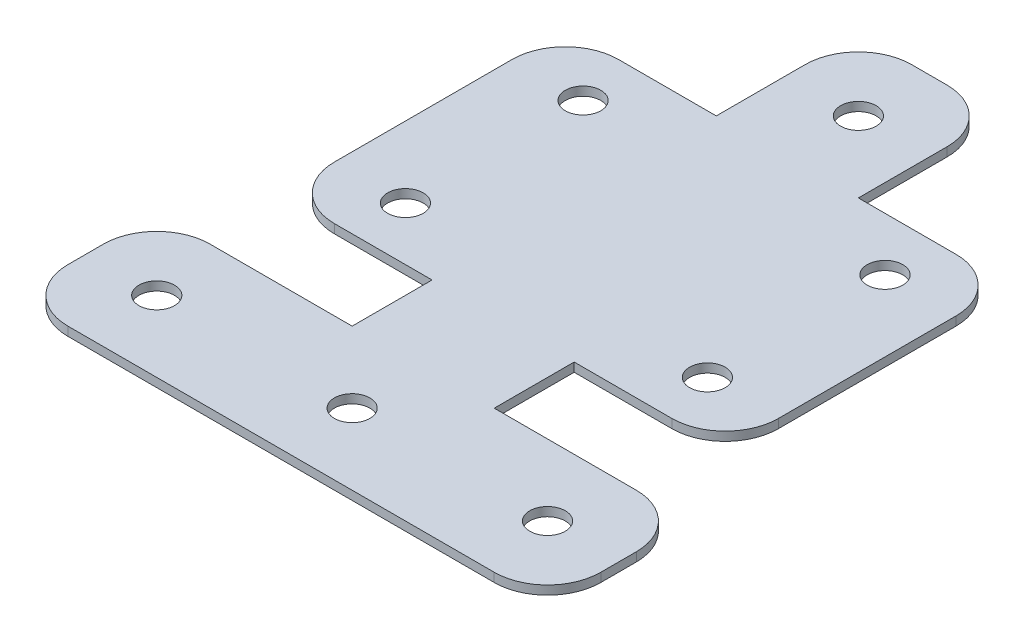
ISO-10303-21;
HEADER;
FILE_DESCRIPTION(('STEP AP214'),'2;1');
FILE_NAME('part.step','',(''),(''),'','','');
FILE_SCHEMA(('AUTOMOTIVE_DESIGN { 1 0 10303 214 1 1 1 1 }'));
ENDSEC;
DATA;
#1=APPLICATION_CONTEXT('core data for automotive mechanical design processes');
#2=APPLICATION_PROTOCOL_DEFINITION('international standard','automotive_design',2000,#1);
#3=PRODUCT_CONTEXT('',#1,'mechanical');
#4=PRODUCT('Part','Part','',(#3));
#5=PRODUCT_RELATED_PRODUCT_CATEGORY('part','',(#4));
#6=PRODUCT_DEFINITION_FORMATION('','',#4);
#7=PRODUCT_DEFINITION_CONTEXT('part definition',#1,'design');
#8=PRODUCT_DEFINITION('design','',#6,#7);
#9=PRODUCT_DEFINITION_SHAPE('','',#8);
#10=(LENGTH_UNIT() NAMED_UNIT(*) SI_UNIT(.MILLI.,.METRE.));
#11=(NAMED_UNIT(*) PLANE_ANGLE_UNIT() SI_UNIT($,.RADIAN.));
#12=(NAMED_UNIT(*) SI_UNIT($,.STERADIAN.) SOLID_ANGLE_UNIT());
#13=UNCERTAINTY_MEASURE_WITH_UNIT(LENGTH_MEASURE(1.E-05),#10,'distance_accuracy_value','');
#14=(GEOMETRIC_REPRESENTATION_CONTEXT(3) GLOBAL_UNCERTAINTY_ASSIGNED_CONTEXT((#13)) GLOBAL_UNIT_ASSIGNED_CONTEXT((#10,
#11,#12)) REPRESENTATION_CONTEXT('',''));
#15=CARTESIAN_POINT('',(0.,0.,0.));
#16=DIRECTION('',(0.,0.,1.));
#17=DIRECTION('',(1.,0.,0.));
#18=AXIS2_PLACEMENT_3D('',#15,#16,#17);
#19=CARTESIAN_POINT('',(0.,1.5875,0.));
#20=DIRECTION('',(0.,1.,0.));
#21=DIRECTION('',(0.,0.,1.));
#22=AXIS2_PLACEMENT_3D('',#19,#20,#21);
#23=PLANE('',#22);
#24=CARTESIAN_POINT('',(-26.9875,1.5875,-68.2625));
#25=DIRECTION('',(0.,1.,0.));
#26=DIRECTION('',(0.,0.,1.));
#27=AXIS2_PLACEMENT_3D('',#24,#25,#26);
#28=CIRCLE('',#27,3.175);
#29=CARTESIAN_POINT('',(-26.9875,1.5875,-65.0875));
#30=VERTEX_POINT('',#29);
#31=EDGE_CURVE('E986',#30,#30,#28,.T.);
#32=ORIENTED_EDGE('',*,*,#31,.F.);
#33=EDGE_LOOP('',(#32));
#34=FACE_BOUND('',#33,.T.);
#35=CARTESIAN_POINT('',(0.,1.5875,0.));
#36=DIRECTION('',(0.,1.,0.));
#37=DIRECTION('',(0.,0.,1.));
#38=AXIS2_PLACEMENT_3D('',#35,#36,#37);
#39=CIRCLE('',#38,3.175);
#40=CARTESIAN_POINT('',(0.,1.5875,3.175));
#41=VERTEX_POINT('',#40);
#42=EDGE_CURVE('E970',#41,#41,#39,.T.);
#43=ORIENTED_EDGE('',*,*,#42,.F.);
#44=EDGE_LOOP('',(#43));
#45=FACE_BOUND('',#44,.T.);
#46=CARTESIAN_POINT('',(0.,1.5875,-90.4875));
#47=DIRECTION('',(0.,1.,0.));
#48=DIRECTION('',(0.,0.,1.));
#49=AXIS2_PLACEMENT_3D('',#46,#47,#48);
#50=CIRCLE('',#49,3.175);
#51=CARTESIAN_POINT('',(0.,1.5875,-87.3125));
#52=VERTEX_POINT('',#51);
#53=EDGE_CURVE('E956',#52,#52,#50,.T.);
#54=ORIENTED_EDGE('',*,*,#53,.F.);
#55=EDGE_LOOP('',(#54));
#56=FACE_BOUND('',#55,.T.);
#57=CARTESIAN_POINT('',(26.9875,1.5875,-36.5125));
#58=DIRECTION('',(0.,1.,0.));
#59=DIRECTION('',(0.,0.,1.));
#60=AXIS2_PLACEMENT_3D('',#57,#58,#59);
#61=CIRCLE('',#60,3.175);
#62=CARTESIAN_POINT('',(26.9875,1.5875,-33.3375));
#63=VERTEX_POINT('',#62);
#64=EDGE_CURVE('E297',#63,#63,#61,.T.);
#65=ORIENTED_EDGE('',*,*,#64,.F.);
#66=EDGE_LOOP('',(#65));
#67=FACE_BOUND('',#66,.T.);
#68=DIRECTION('',(-1.,0.,0.));
#69=VECTOR('',#68,1.);
#70=CARTESIAN_POINT('',(-12.7,1.5875,-103.1875));
#71=LINE('',#70,#69);
#72=CARTESIAN_POINT('',(3.17499999999999,1.5875,-103.1875));
#73=VERTEX_POINT('',#72);
#74=CARTESIAN_POINT('',(-3.175,1.5875,-103.1875));
#75=VERTEX_POINT('',#74);
#76=EDGE_CURVE('E256',#73,#75,#71,.T.);
#77=ORIENTED_EDGE('',*,*,#76,.T.);
#78=CARTESIAN_POINT('',(-3.175,1.5875,-93.6625));
#79=DIRECTION('',(0.,1.,0.));
#80=DIRECTION('',(0.,0.,1.));
#81=AXIS2_PLACEMENT_3D('',#78,#79,#80);
#82=CIRCLE('',#81,9.525);
#83=CARTESIAN_POINT('',(-12.7,1.5875,-93.6625));
#84=VERTEX_POINT('',#83);
#85=EDGE_CURVE('E433',#75,#84,#82,.T.);
#86=ORIENTED_EDGE('',*,*,#85,.T.);
#87=DIRECTION('',(0.,0.,1.));
#88=VECTOR('',#87,1.);
#89=CARTESIAN_POINT('',(-12.7,1.5875,-77.7875));
#90=LINE('',#89,#88);
#91=CARTESIAN_POINT('',(-12.7,1.5875,-77.7875));
#92=VERTEX_POINT('',#91);
#93=EDGE_CURVE('E259',#84,#92,#90,.T.);
#94=ORIENTED_EDGE('',*,*,#93,.T.);
#95=DIRECTION('',(-1.,0.,0.));
#96=VECTOR('',#95,1.);
#97=CARTESIAN_POINT('',(-14.2875,1.5875,-77.7875));
#98=LINE('',#97,#96);
#99=CARTESIAN_POINT('',(-30.1625,1.5875,-77.7874999999999));
#100=VERTEX_POINT('',#99);
#101=EDGE_CURVE('E262',#92,#100,#98,.T.);
#102=ORIENTED_EDGE('',*,*,#101,.T.);
#103=CARTESIAN_POINT('',(-30.1625,1.5875,-68.2625));
#104=DIRECTION('',(0.,1.,0.));
#105=DIRECTION('',(0.,0.,1.));
#106=AXIS2_PLACEMENT_3D('',#103,#104,#105);
#107=CIRCLE('',#106,9.525);
#108=CARTESIAN_POINT('',(-39.6875,1.5875,-68.2625));
#109=VERTEX_POINT('',#108);
#110=EDGE_CURVE('E413',#100,#109,#107,.T.);
#111=ORIENTED_EDGE('',*,*,#110,.T.);
#112=DIRECTION('',(0.,0.,1.));
#113=VECTOR('',#112,1.);
#114=CARTESIAN_POINT('',(-39.6875,1.5875,-77.7875));
#115=LINE('',#114,#113);
#116=CARTESIAN_POINT('',(-39.6875,1.5875,-36.5125));
#117=VERTEX_POINT('',#116);
#118=EDGE_CURVE('E266',#109,#117,#115,.T.);
#119=ORIENTED_EDGE('',*,*,#118,.T.);
#120=CARTESIAN_POINT('',(-30.1625,1.5875,-36.5125));
#121=DIRECTION('',(0.,1.,0.));
#122=DIRECTION('',(0.,0.,1.));
#123=AXIS2_PLACEMENT_3D('',#120,#121,#122);
#124=CIRCLE('',#123,9.525);
#125=CARTESIAN_POINT('',(-30.1625,1.5875,-26.9875));
#126=VERTEX_POINT('',#125);
#127=EDGE_CURVE('E416',#117,#126,#124,.T.);
#128=ORIENTED_EDGE('',*,*,#127,.T.);
#129=DIRECTION('',(1.,0.,0.));
#130=VECTOR('',#129,1.);
#131=CARTESIAN_POINT('',(-39.6875,1.5875,-26.9875));
#132=LINE('',#131,#130);
#133=CARTESIAN_POINT('',(-12.7,1.5875,-26.9875));
#134=VERTEX_POINT('',#133);
#135=EDGE_CURVE('E270',#126,#134,#132,.T.);
#136=ORIENTED_EDGE('',*,*,#135,.T.);
#137=DIRECTION('',(0.,0.,1.));
#138=VECTOR('',#137,1.);
#139=CARTESIAN_POINT('',(-12.7,1.5875,-25.4));
#140=LINE('',#139,#138);
#141=CARTESIAN_POINT('',(-12.7,1.5875,-12.7));
#142=VERTEX_POINT('',#141);
#143=EDGE_CURVE('E273',#134,#142,#140,.T.);
#144=ORIENTED_EDGE('',*,*,#143,.T.);
#145=DIRECTION('',(-1.,0.,0.));
#146=VECTOR('',#145,1.);
#147=CARTESIAN_POINT('',(-22.225,1.5875,-12.7));
#148=LINE('',#147,#146);
#149=CARTESIAN_POINT('',(-38.1,1.5875,-12.7));
#150=VERTEX_POINT('',#149);
#151=EDGE_CURVE('E276',#142,#150,#148,.T.);
#152=ORIENTED_EDGE('',*,*,#151,.T.);
#153=CARTESIAN_POINT('',(-38.1,1.5875,-3.17499999999999));
#154=DIRECTION('',(0.,1.,0.));
#155=DIRECTION('',(0.,0.,1.));
#156=AXIS2_PLACEMENT_3D('',#153,#154,#155);
#157=CIRCLE('',#156,9.525);
#158=CARTESIAN_POINT('',(-47.625,1.5875,-3.17499999999999));
#159=VERTEX_POINT('',#158);
#160=EDGE_CURVE('E419',#150,#159,#157,.T.);
#161=ORIENTED_EDGE('',*,*,#160,.T.);
#162=DIRECTION('',(0.,0.,1.));
#163=VECTOR('',#162,1.);
#164=CARTESIAN_POINT('',(-47.625,1.5875,-12.7));
#165=LINE('',#164,#163);
#166=CARTESIAN_POINT('',(-47.625,1.5875,3.175));
#167=VERTEX_POINT('',#166);
#168=EDGE_CURVE('E280',#159,#167,#165,.T.);
#169=ORIENTED_EDGE('',*,*,#168,.T.);
#170=CARTESIAN_POINT('',(-38.1,1.5875,3.17500000000001));
#171=DIRECTION('',(0.,1.,0.));
#172=DIRECTION('',(0.,0.,1.));
#173=AXIS2_PLACEMENT_3D('',#170,#171,#172);
#174=CIRCLE('',#173,9.525);
#175=CARTESIAN_POINT('',(-38.1,1.5875,12.7));
#176=VERTEX_POINT('',#175);
#177=EDGE_CURVE('E422',#167,#176,#174,.T.);
#178=ORIENTED_EDGE('',*,*,#177,.T.);
#179=DIRECTION('',(1.,0.,0.));
#180=VECTOR('',#179,1.);
#181=CARTESIAN_POINT('',(-47.625,1.5875,12.7));
#182=LINE('',#181,#180);
#183=CARTESIAN_POINT('',(38.1,1.5875,12.7));
#184=VERTEX_POINT('',#183);
#185=EDGE_CURVE('E284',#176,#184,#182,.T.);
#186=ORIENTED_EDGE('',*,*,#185,.T.);
#187=CARTESIAN_POINT('',(38.1,1.5875,3.175));
#188=DIRECTION('',(0.,1.,0.));
#189=DIRECTION('',(0.,0.,1.));
#190=AXIS2_PLACEMENT_3D('',#187,#188,#189);
#191=CIRCLE('',#190,9.525);
#192=CARTESIAN_POINT('',(47.625,1.5875,3.175));
#193=VERTEX_POINT('',#192);
#194=EDGE_CURVE('E425',#184,#193,#191,.T.);
#195=ORIENTED_EDGE('',*,*,#194,.T.);
#196=DIRECTION('',(0.,0.,-1.));
#197=VECTOR('',#196,1.);
#198=CARTESIAN_POINT('',(47.625,1.5875,-12.7));
#199=LINE('',#198,#197);
#200=CARTESIAN_POINT('',(47.625,1.5875,-3.175));
#201=VERTEX_POINT('',#200);
#202=EDGE_CURVE('E288',#193,#201,#199,.T.);
#203=ORIENTED_EDGE('',*,*,#202,.T.);
#204=CARTESIAN_POINT('',(38.1,1.5875,-3.175));
#205=DIRECTION('',(0.,1.,0.));
#206=DIRECTION('',(0.,0.,1.));
#207=AXIS2_PLACEMENT_3D('',#204,#205,#206);
#208=CIRCLE('',#207,9.525);
#209=CARTESIAN_POINT('',(38.1,1.5875,-12.7));
#210=VERTEX_POINT('',#209);
#211=EDGE_CURVE('E55',#201,#210,#208,.T.);
#212=ORIENTED_EDGE('',*,*,#211,.T.);
#213=DIRECTION('',(-1.,0.,0.));
#214=VECTOR('',#213,1.);
#215=CARTESIAN_POINT('',(22.225,1.5875,-12.7));
#216=LINE('',#215,#214);
#217=CARTESIAN_POINT('',(12.7,1.5875,-12.7));
#218=VERTEX_POINT('',#217);
#219=EDGE_CURVE('E220',#210,#218,#216,.T.);
#220=ORIENTED_EDGE('',*,*,#219,.T.);
#221=DIRECTION('',(0.,0.,-1.));
#222=VECTOR('',#221,1.);
#223=CARTESIAN_POINT('',(12.7,1.5875,-25.4));
#224=LINE('',#223,#222);
#225=CARTESIAN_POINT('',(12.7,1.5875,-26.9875));
#226=VERTEX_POINT('',#225);
#227=EDGE_CURVE('E213',#218,#226,#224,.T.);
#228=ORIENTED_EDGE('',*,*,#227,.T.);
#229=DIRECTION('',(1.,0.,0.));
#230=VECTOR('',#229,1.);
#231=CARTESIAN_POINT('',(14.2875,1.5875,-26.9875));
#232=LINE('',#231,#230);
#233=CARTESIAN_POINT('',(30.1625,1.5875,-26.9875));
#234=VERTEX_POINT('',#233);
#235=EDGE_CURVE('E218',#226,#234,#232,.T.);
#236=ORIENTED_EDGE('',*,*,#235,.T.);
#237=CARTESIAN_POINT('',(30.1625,1.5875,-36.5125));
#238=DIRECTION('',(0.,1.,0.));
#239=DIRECTION('',(0.,0.,1.));
#240=AXIS2_PLACEMENT_3D('',#237,#238,#239);
#241=CIRCLE('',#240,9.525);
#242=CARTESIAN_POINT('',(39.6875,1.5875,-36.5125));
#243=VERTEX_POINT('',#242);
#244=EDGE_CURVE('E407',#234,#243,#241,.T.);
#245=ORIENTED_EDGE('',*,*,#244,.T.);
#246=DIRECTION('',(0.,0.,-1.));
#247=VECTOR('',#246,1.);
#248=CARTESIAN_POINT('',(39.6875,1.5875,-26.9875));
#249=LINE('',#248,#247);
#250=CARTESIAN_POINT('',(39.6875,1.5875,-68.2625));
#251=VERTEX_POINT('',#250);
#252=EDGE_CURVE('E242',#243,#251,#249,.T.);
#253=ORIENTED_EDGE('',*,*,#252,.T.);
#254=CARTESIAN_POINT('',(30.1625,1.5875,-68.2625));
#255=DIRECTION('',(0.,1.,0.));
#256=DIRECTION('',(0.,0.,1.));
#257=AXIS2_PLACEMENT_3D('',#254,#255,#256);
#258=CIRCLE('',#257,9.525);
#259=CARTESIAN_POINT('',(30.1625,1.5875,-77.7875));
#260=VERTEX_POINT('',#259);
#261=EDGE_CURVE('E410',#251,#260,#258,.T.);
#262=ORIENTED_EDGE('',*,*,#261,.T.);
#263=DIRECTION('',(-1.,0.,0.));
#264=VECTOR('',#263,1.);
#265=CARTESIAN_POINT('',(39.6875,1.5875,-77.7875));
#266=LINE('',#265,#264);
#267=CARTESIAN_POINT('',(12.7,1.5875,-77.7875));
#268=VERTEX_POINT('',#267);
#269=EDGE_CURVE('E246',#260,#268,#266,.T.);
#270=ORIENTED_EDGE('',*,*,#269,.T.);
#271=DIRECTION('',(0.,0.,-1.));
#272=VECTOR('',#271,1.);
#273=CARTESIAN_POINT('',(12.7,1.5875,-103.1875));
#274=LINE('',#273,#272);
#275=CARTESIAN_POINT('',(12.7,1.5875,-93.6625));
#276=VERTEX_POINT('',#275);
#277=EDGE_CURVE('E252',#268,#276,#274,.T.);
#278=ORIENTED_EDGE('',*,*,#277,.T.);
#279=CARTESIAN_POINT('',(3.17499999999999,1.5875,-93.6625));
#280=DIRECTION('',(0.,1.,0.));
#281=DIRECTION('',(0.,0.,1.));
#282=AXIS2_PLACEMENT_3D('',#279,#280,#281);
#283=CIRCLE('',#282,9.525);
#284=EDGE_CURVE('E430',#276,#73,#283,.T.);
#285=ORIENTED_EDGE('',*,*,#284,.T.);
#286=EDGE_LOOP('',(#77,#86,#94,#102,#111,#119,#128,#136,#144,#152,#161,#169,#178,#186,#195,#203,
#212,#220,#228,#236,#245,#253,#262,#270,#278,#285));
#287=FACE_BOUND('',#286,.T.);
#288=CARTESIAN_POINT('',(26.9875,1.5875,-68.2625));
#289=DIRECTION('',(0.,1.,0.));
#290=DIRECTION('',(0.,0.,1.));
#291=AXIS2_PLACEMENT_3D('',#288,#289,#290);
#292=CIRCLE('',#291,3.175);
#293=CARTESIAN_POINT('',(26.9875,1.5875,-65.0875));
#294=VERTEX_POINT('',#293);
#295=EDGE_CURVE('E946',#294,#294,#292,.T.);
#296=ORIENTED_EDGE('',*,*,#295,.F.);
#297=EDGE_LOOP('',(#296));
#298=FACE_BOUND('',#297,.T.);
#299=CARTESIAN_POINT('',(34.925,1.5875,0.));
#300=DIRECTION('',(0.,1.,0.));
#301=DIRECTION('',(0.,0.,1.));
#302=AXIS2_PLACEMENT_3D('',#299,#300,#301);
#303=CIRCLE('',#302,3.175);
#304=CARTESIAN_POINT('',(34.925,1.5875,3.17499999999999));
#305=VERTEX_POINT('',#304);
#306=EDGE_CURVE('E962',#305,#305,#303,.T.);
#307=ORIENTED_EDGE('',*,*,#306,.F.);
#308=EDGE_LOOP('',(#307));
#309=FACE_BOUND('',#308,.T.);
#310=CARTESIAN_POINT('',(-34.925,1.5875,0.));
#311=DIRECTION('',(0.,1.,0.));
#312=DIRECTION('',(0.,0.,1.));
#313=AXIS2_PLACEMENT_3D('',#310,#311,#312);
#314=CIRCLE('',#313,3.175);
#315=CARTESIAN_POINT('',(-34.925,1.5875,3.175));
#316=VERTEX_POINT('',#315);
#317=EDGE_CURVE('E978',#316,#316,#314,.T.);
#318=ORIENTED_EDGE('',*,*,#317,.F.);
#319=EDGE_LOOP('',(#318));
#320=FACE_BOUND('',#319,.T.);
#321=CARTESIAN_POINT('',(-26.9875,1.5875,-36.5125));
#322=DIRECTION('',(0.,1.,0.));
#323=DIRECTION('',(0.,0.,1.));
#324=AXIS2_PLACEMENT_3D('',#321,#322,#323);
#325=CIRCLE('',#324,3.175);
#326=CARTESIAN_POINT('',(-26.9875,1.5875,-33.3375));
#327=VERTEX_POINT('',#326);
#328=EDGE_CURVE('E994',#327,#327,#325,.T.);
#329=ORIENTED_EDGE('',*,*,#328,.F.);
#330=EDGE_LOOP('',(#329));
#331=FACE_BOUND('',#330,.T.);
#332=ADVANCED_FACE('F39',(#34,#45,#56,#67,#287,#298,#309,#320,#331),#23,.T.);
#333=CARTESIAN_POINT('',(0.,0.,0.));
#334=DIRECTION('',(0.,1.,0.));
#335=DIRECTION('',(0.,0.,1.));
#336=AXIS2_PLACEMENT_3D('',#333,#334,#335);
#337=PLANE('',#336);
#338=DIRECTION('',(0.,0.,1.));
#339=VECTOR('',#338,1.);
#340=CARTESIAN_POINT('',(-12.7,0.,-77.7875));
#341=LINE('',#340,#339);
#342=CARTESIAN_POINT('',(-12.7,0.,-93.6625));
#343=VERTEX_POINT('',#342);
#344=CARTESIAN_POINT('',(-12.7,0.,-77.7875));
#345=VERTEX_POINT('',#344);
#346=EDGE_CURVE('E315',#343,#345,#341,.T.);
#347=ORIENTED_EDGE('',*,*,#346,.F.);
#348=CARTESIAN_POINT('',(-3.175,0.,-93.6625));
#349=DIRECTION('',(0.,1.,0.));
#350=DIRECTION('',(0.,0.,1.));
#351=AXIS2_PLACEMENT_3D('',#348,#349,#350);
#352=CIRCLE('',#351,9.525);
#353=CARTESIAN_POINT('',(-3.175,0.,-103.1875));
#354=VERTEX_POINT('',#353);
#355=EDGE_CURVE('E397',#343,#354,#352,.F.);
#356=ORIENTED_EDGE('',*,*,#355,.T.);
#357=DIRECTION('',(-1.,0.,0.));
#358=VECTOR('',#357,1.);
#359=CARTESIAN_POINT('',(-12.7,0.,-103.1875));
#360=LINE('',#359,#358);
#361=CARTESIAN_POINT('',(3.17499999999999,0.,-103.1875));
#362=VERTEX_POINT('',#361);
#363=EDGE_CURVE('E311',#362,#354,#360,.T.);
#364=ORIENTED_EDGE('',*,*,#363,.F.);
#365=CARTESIAN_POINT('',(3.17499999999999,0.,-93.6625));
#366=DIRECTION('',(0.,1.,0.));
#367=DIRECTION('',(0.,0.,1.));
#368=AXIS2_PLACEMENT_3D('',#365,#366,#367);
#369=CIRCLE('',#368,9.525);
#370=CARTESIAN_POINT('',(12.7,0.,-93.6625));
#371=VERTEX_POINT('',#370);
#372=EDGE_CURVE('E394',#362,#371,#369,.F.);
#373=ORIENTED_EDGE('',*,*,#372,.T.);
#374=DIRECTION('',(0.,0.,-1.));
#375=VECTOR('',#374,1.);
#376=CARTESIAN_POINT('',(12.7,0.,-103.1875));
#377=LINE('',#376,#375);
#378=CARTESIAN_POINT('',(12.7,0.,-77.7875));
#379=VERTEX_POINT('',#378);
#380=EDGE_CURVE('E307',#379,#371,#377,.T.);
#381=ORIENTED_EDGE('',*,*,#380,.F.);
#382=DIRECTION('',(-1.,0.,0.));
#383=VECTOR('',#382,1.);
#384=CARTESIAN_POINT('',(12.7,0.,-77.7875));
#385=LINE('',#384,#383);
#386=CARTESIAN_POINT('',(30.1625,0.,-77.7875));
#387=VERTEX_POINT('',#386);
#388=EDGE_CURVE('E304',#387,#379,#385,.T.);
#389=ORIENTED_EDGE('',*,*,#388,.F.);
#390=CARTESIAN_POINT('',(30.1625,0.,-68.2625));
#391=DIRECTION('',(0.,1.,0.));
#392=DIRECTION('',(0.,0.,1.));
#393=AXIS2_PLACEMENT_3D('',#390,#391,#392);
#394=CIRCLE('',#393,9.525);
#395=CARTESIAN_POINT('',(39.6875,0.,-68.2625));
#396=VERTEX_POINT('',#395);
#397=EDGE_CURVE('E373',#387,#396,#394,.F.);
#398=ORIENTED_EDGE('',*,*,#397,.T.);
#399=DIRECTION('',(0.,0.,-1.));
#400=VECTOR('',#399,1.);
#401=CARTESIAN_POINT('',(39.6875,0.,-26.9875));
#402=LINE('',#401,#400);
#403=CARTESIAN_POINT('',(39.6875,0.,-36.5125));
#404=VERTEX_POINT('',#403);
#405=EDGE_CURVE('E300',#404,#396,#402,.T.);
#406=ORIENTED_EDGE('',*,*,#405,.F.);
#407=CARTESIAN_POINT('',(30.1625,0.,-36.5125));
#408=DIRECTION('',(0.,1.,0.));
#409=DIRECTION('',(0.,0.,1.));
#410=AXIS2_PLACEMENT_3D('',#407,#408,#409);
#411=CIRCLE('',#410,9.525);
#412=CARTESIAN_POINT('',(30.1625,0.,-26.9875));
#413=VERTEX_POINT('',#412);
#414=EDGE_CURVE('E370',#404,#413,#411,.F.);
#415=ORIENTED_EDGE('',*,*,#414,.T.);
#416=DIRECTION('',(1.,0.,0.));
#417=VECTOR('',#416,1.);
#418=CARTESIAN_POINT('',(14.2875,0.,-26.9875));
#419=LINE('',#418,#417);
#420=CARTESIAN_POINT('',(12.7,0.,-26.9875));
#421=VERTEX_POINT('',#420);
#422=EDGE_CURVE('E296',#421,#413,#419,.T.);
#423=ORIENTED_EDGE('',*,*,#422,.F.);
#424=DIRECTION('',(0.,0.,-1.));
#425=VECTOR('',#424,1.);
#426=CARTESIAN_POINT('',(12.7,0.,-26.9875));
#427=LINE('',#426,#425);
#428=CARTESIAN_POINT('',(12.7,0.,-12.7));
#429=VERTEX_POINT('',#428);
#430=EDGE_CURVE('E232',#429,#421,#427,.T.);
#431=ORIENTED_EDGE('',*,*,#430,.F.);
#432=DIRECTION('',(-1.,0.,0.));
#433=VECTOR('',#432,1.);
#434=CARTESIAN_POINT('',(12.7,0.,-12.7));
#435=LINE('',#434,#433);
#436=CARTESIAN_POINT('',(38.1,0.,-12.7));
#437=VERTEX_POINT('',#436);
#438=EDGE_CURVE('E225',#437,#429,#435,.T.);
#439=ORIENTED_EDGE('',*,*,#438,.F.);
#440=CARTESIAN_POINT('',(38.1,0.,-3.175));
#441=DIRECTION('',(0.,1.,0.));
#442=DIRECTION('',(0.,0.,1.));
#443=AXIS2_PLACEMENT_3D('',#440,#441,#442);
#444=CIRCLE('',#443,9.525);
#445=CARTESIAN_POINT('',(47.625,0.,-3.175));
#446=VERTEX_POINT('',#445);
#447=EDGE_CURVE('E391',#437,#446,#444,.F.);
#448=ORIENTED_EDGE('',*,*,#447,.T.);
#449=DIRECTION('',(0.,0.,-1.));
#450=VECTOR('',#449,1.);
#451=CARTESIAN_POINT('',(47.625,0.,-12.7));
#452=LINE('',#451,#450);
#453=CARTESIAN_POINT('',(47.625,0.,3.175));
#454=VERTEX_POINT('',#453);
#455=EDGE_CURVE('E345',#454,#446,#452,.T.);
#456=ORIENTED_EDGE('',*,*,#455,.F.);
#457=CARTESIAN_POINT('',(38.1,0.,3.175));
#458=DIRECTION('',(0.,1.,0.));
#459=DIRECTION('',(0.,0.,1.));
#460=AXIS2_PLACEMENT_3D('',#457,#458,#459);
#461=CIRCLE('',#460,9.525);
#462=CARTESIAN_POINT('',(38.1,0.,12.7));
#463=VERTEX_POINT('',#462);
#464=EDGE_CURVE('E388',#454,#463,#461,.F.);
#465=ORIENTED_EDGE('',*,*,#464,.T.);
#466=DIRECTION('',(1.,0.,0.));
#467=VECTOR('',#466,1.);
#468=CARTESIAN_POINT('',(47.625,0.,12.7));
#469=LINE('',#468,#467);
#470=CARTESIAN_POINT('',(-38.1,0.,12.7));
#471=VERTEX_POINT('',#470);
#472=EDGE_CURVE('E341',#471,#463,#469,.T.);
#473=ORIENTED_EDGE('',*,*,#472,.F.);
#474=CARTESIAN_POINT('',(-38.1,0.,3.17500000000001));
#475=DIRECTION('',(0.,1.,0.));
#476=DIRECTION('',(0.,0.,1.));
#477=AXIS2_PLACEMENT_3D('',#474,#475,#476);
#478=CIRCLE('',#477,9.525);
#479=CARTESIAN_POINT('',(-47.625,0.,3.175));
#480=VERTEX_POINT('',#479);
#481=EDGE_CURVE('E385',#471,#480,#478,.F.);
#482=ORIENTED_EDGE('',*,*,#481,.T.);
#483=DIRECTION('',(0.,0.,1.));
#484=VECTOR('',#483,1.);
#485=CARTESIAN_POINT('',(-47.625,0.,-12.7));
#486=LINE('',#485,#484);
#487=CARTESIAN_POINT('',(-47.625,0.,-3.17499999999999));
#488=VERTEX_POINT('',#487);
#489=EDGE_CURVE('E337',#488,#480,#486,.T.);
#490=ORIENTED_EDGE('',*,*,#489,.F.);
#491=CARTESIAN_POINT('',(-38.1,0.,-3.17499999999999));
#492=DIRECTION('',(0.,1.,0.));
#493=DIRECTION('',(0.,0.,1.));
#494=AXIS2_PLACEMENT_3D('',#491,#492,#493);
#495=CIRCLE('',#494,9.525);
#496=CARTESIAN_POINT('',(-38.1,0.,-12.7));
#497=VERTEX_POINT('',#496);
#498=EDGE_CURVE('E382',#488,#497,#495,.F.);
#499=ORIENTED_EDGE('',*,*,#498,.T.);
#500=DIRECTION('',(-1.,0.,0.));
#501=VECTOR('',#500,1.);
#502=CARTESIAN_POINT('',(-22.225,0.,-12.7));
#503=LINE('',#502,#501);
#504=CARTESIAN_POINT('',(-12.7,0.,-12.7));
#505=VERTEX_POINT('',#504);
#506=EDGE_CURVE('E333',#505,#497,#503,.T.);
#507=ORIENTED_EDGE('',*,*,#506,.F.);
#508=DIRECTION('',(0.,0.,1.));
#509=VECTOR('',#508,1.);
#510=CARTESIAN_POINT('',(-12.7,0.,-12.7));
#511=LINE('',#510,#509);
#512=CARTESIAN_POINT('',(-12.7,0.,-26.9875));
#513=VERTEX_POINT('',#512);
#514=EDGE_CURVE('E329',#513,#505,#511,.T.);
#515=ORIENTED_EDGE('',*,*,#514,.F.);
#516=DIRECTION('',(1.,0.,0.));
#517=VECTOR('',#516,1.);
#518=CARTESIAN_POINT('',(-12.7,0.,-26.9875));
#519=LINE('',#518,#517);
#520=CARTESIAN_POINT('',(-30.1625,0.,-26.9875));
#521=VERTEX_POINT('',#520);
#522=EDGE_CURVE('E326',#521,#513,#519,.T.);
#523=ORIENTED_EDGE('',*,*,#522,.F.);
#524=CARTESIAN_POINT('',(-30.1625,0.,-36.5125));
#525=DIRECTION('',(0.,1.,0.));
#526=DIRECTION('',(0.,0.,1.));
#527=AXIS2_PLACEMENT_3D('',#524,#525,#526);
#528=CIRCLE('',#527,9.525);
#529=CARTESIAN_POINT('',(-39.6875,0.,-36.5125));
#530=VERTEX_POINT('',#529);
#531=EDGE_CURVE('E379',#521,#530,#528,.F.);
#532=ORIENTED_EDGE('',*,*,#531,.T.);
#533=DIRECTION('',(0.,0.,1.));
#534=VECTOR('',#533,1.);
#535=CARTESIAN_POINT('',(-39.6875,0.,-77.7875));
#536=LINE('',#535,#534);
#537=CARTESIAN_POINT('',(-39.6875,0.,-68.2625));
#538=VERTEX_POINT('',#537);
#539=EDGE_CURVE('E322',#538,#530,#536,.T.);
#540=ORIENTED_EDGE('',*,*,#539,.F.);
#541=CARTESIAN_POINT('',(-30.1625,0.,-68.2625));
#542=DIRECTION('',(0.,1.,0.));
#543=DIRECTION('',(0.,0.,1.));
#544=AXIS2_PLACEMENT_3D('',#541,#542,#543);
#545=CIRCLE('',#544,9.525);
#546=CARTESIAN_POINT('',(-30.1625,0.,-77.7875));
#547=VERTEX_POINT('',#546);
#548=EDGE_CURVE('E376',#538,#547,#545,.F.);
#549=ORIENTED_EDGE('',*,*,#548,.T.);
#550=DIRECTION('',(-1.,0.,0.));
#551=VECTOR('',#550,1.);
#552=CARTESIAN_POINT('',(-14.2875,0.,-77.7875));
#553=LINE('',#552,#551);
#554=EDGE_CURVE('E318',#345,#547,#553,.T.);
#555=ORIENTED_EDGE('',*,*,#554,.F.);
#556=EDGE_LOOP('',(#347,#356,#364,#373,#381,#389,#398,#406,#415,#423,#431,#439,#448,#456,#465,
#473,#482,#490,#499,#507,#515,#523,#532,#540,#549,#555));
#557=FACE_BOUND('',#556,.T.);
#558=CARTESIAN_POINT('',(26.9875,0.,-36.5125));
#559=DIRECTION('',(0.,1.,0.));
#560=DIRECTION('',(0.,0.,1.));
#561=AXIS2_PLACEMENT_3D('',#558,#559,#560);
#562=CIRCLE('',#561,3.175);
#563=CARTESIAN_POINT('',(26.9875,0.,-33.3375));
#564=VERTEX_POINT('',#563);
#565=EDGE_CURVE('E944',#564,#564,#562,.T.);
#566=ORIENTED_EDGE('',*,*,#565,.T.);
#567=EDGE_LOOP('',(#566));
#568=FACE_BOUND('',#567,.T.);
#569=CARTESIAN_POINT('',(26.9875,0.,-68.2625));
#570=DIRECTION('',(0.,1.,0.));
#571=DIRECTION('',(0.,0.,1.));
#572=AXIS2_PLACEMENT_3D('',#569,#570,#571);
#573=CIRCLE('',#572,3.175);
#574=CARTESIAN_POINT('',(26.9875,0.,-65.0875));
#575=VERTEX_POINT('',#574);
#576=EDGE_CURVE('E951',#575,#575,#573,.T.);
#577=ORIENTED_EDGE('',*,*,#576,.T.);
#578=EDGE_LOOP('',(#577));
#579=FACE_BOUND('',#578,.T.);
#580=CARTESIAN_POINT('',(0.,0.,-90.4875));
#581=DIRECTION('',(0.,1.,0.));
#582=DIRECTION('',(0.,0.,1.));
#583=AXIS2_PLACEMENT_3D('',#580,#581,#582);
#584=CIRCLE('',#583,3.175);
#585=CARTESIAN_POINT('',(0.,0.,-87.3125));
#586=VERTEX_POINT('',#585);
#587=EDGE_CURVE('E958',#586,#586,#584,.T.);
#588=ORIENTED_EDGE('',*,*,#587,.T.);
#589=EDGE_LOOP('',(#588));
#590=FACE_BOUND('',#589,.T.);
#591=CARTESIAN_POINT('',(34.925,0.,0.));
#592=DIRECTION('',(0.,1.,0.));
#593=DIRECTION('',(0.,0.,1.));
#594=AXIS2_PLACEMENT_3D('',#591,#592,#593);
#595=CIRCLE('',#594,3.175);
#596=CARTESIAN_POINT('',(34.925,0.,3.17499999999999));
#597=VERTEX_POINT('',#596);
#598=EDGE_CURVE('E966',#597,#597,#595,.T.);
#599=ORIENTED_EDGE('',*,*,#598,.T.);
#600=EDGE_LOOP('',(#599));
#601=FACE_BOUND('',#600,.T.);
#602=CARTESIAN_POINT('',(0.,0.,0.));
#603=DIRECTION('',(0.,1.,0.));
#604=DIRECTION('',(0.,0.,1.));
#605=AXIS2_PLACEMENT_3D('',#602,#603,#604);
#606=CIRCLE('',#605,3.175);
#607=CARTESIAN_POINT('',(0.,0.,3.175));
#608=VERTEX_POINT('',#607);
#609=EDGE_CURVE('E974',#608,#608,#606,.T.);
#610=ORIENTED_EDGE('',*,*,#609,.T.);
#611=EDGE_LOOP('',(#610));
#612=FACE_BOUND('',#611,.T.);
#613=CARTESIAN_POINT('',(-34.925,0.,0.));
#614=DIRECTION('',(0.,1.,0.));
#615=DIRECTION('',(0.,0.,1.));
#616=AXIS2_PLACEMENT_3D('',#613,#614,#615);
#617=CIRCLE('',#616,3.175);
#618=CARTESIAN_POINT('',(-34.925,0.,3.175));
#619=VERTEX_POINT('',#618);
#620=EDGE_CURVE('E982',#619,#619,#617,.T.);
#621=ORIENTED_EDGE('',*,*,#620,.T.);
#622=EDGE_LOOP('',(#621));
#623=FACE_BOUND('',#622,.T.);
#624=CARTESIAN_POINT('',(-26.9875,0.,-68.2625));
#625=DIRECTION('',(0.,1.,0.));
#626=DIRECTION('',(0.,0.,1.));
#627=AXIS2_PLACEMENT_3D('',#624,#625,#626);
#628=CIRCLE('',#627,3.175);
#629=CARTESIAN_POINT('',(-26.9875,0.,-65.0875));
#630=VERTEX_POINT('',#629);
#631=EDGE_CURVE('E990',#630,#630,#628,.T.);
#632=ORIENTED_EDGE('',*,*,#631,.T.);
#633=EDGE_LOOP('',(#632));
#634=FACE_BOUND('',#633,.T.);
#635=CARTESIAN_POINT('',(-26.9875,0.,-36.5125));
#636=DIRECTION('',(0.,1.,0.));
#637=DIRECTION('',(0.,0.,1.));
#638=AXIS2_PLACEMENT_3D('',#635,#636,#637);
#639=CIRCLE('',#638,3.175);
#640=CARTESIAN_POINT('',(-26.9875,0.,-33.3375));
#641=VERTEX_POINT('',#640);
#642=EDGE_CURVE('E998',#641,#641,#639,.T.);
#643=ORIENTED_EDGE('',*,*,#642,.T.);
#644=EDGE_LOOP('',(#643));
#645=FACE_BOUND('',#644,.T.);
#646=ADVANCED_FACE('F506',(#557,#568,#579,#590,#601,#612,#623,#634,#645),#337,.F.);
#647=CARTESIAN_POINT('',(12.7,1.5875,-26.9875));
#648=DIRECTION('',(-1.,0.,0.));
#649=DIRECTION('',(0.,0.,1.));
#650=AXIS2_PLACEMENT_3D('',#647,#648,#649);
#651=PLANE('',#650);
#652=ORIENTED_EDGE('',*,*,#430,.T.);
#653=DIRECTION('',(0.,-1.,0.));
#654=VECTOR('',#653,1.);
#655=CARTESIAN_POINT('',(12.7,1.5875,-26.9875));
#656=LINE('',#655,#654);
#657=EDGE_CURVE('E229',#226,#421,#656,.T.);
#658=ORIENTED_EDGE('',*,*,#657,.F.);
#659=ORIENTED_EDGE('',*,*,#227,.F.);
#660=DIRECTION('',(0.,-1.,0.));
#661=VECTOR('',#660,1.);
#662=CARTESIAN_POINT('',(12.7,1.5875,-12.7));
#663=LINE('',#662,#661);
#664=EDGE_CURVE('E293',#218,#429,#663,.T.);
#665=ORIENTED_EDGE('',*,*,#664,.T.);
#666=EDGE_LOOP('',(#652,#658,#659,#665));
#667=FACE_BOUND('',#666,.T.);
#668=ADVANCED_FACE('F230',(#667),#651,.F.);
#669=CARTESIAN_POINT('',(14.2875,1.5875,-26.9875));
#670=DIRECTION('',(0.,0.,-1.));
#671=DIRECTION('',(-1.,0.,0.));
#672=AXIS2_PLACEMENT_3D('',#669,#670,#671);
#673=PLANE('',#672);
#674=ORIENTED_EDGE('',*,*,#422,.T.);
#675=DIRECTION('',(0.,-1.,0.));
#676=VECTOR('',#675,1.);
#677=CARTESIAN_POINT('',(30.1625,1.5875,-26.9875));
#678=LINE('',#677,#676);
#679=EDGE_CURVE('E11',#413,#234,#678,.F.);
#680=ORIENTED_EDGE('',*,*,#679,.T.);
#681=ORIENTED_EDGE('',*,*,#235,.F.);
#682=ORIENTED_EDGE('',*,*,#657,.T.);
#683=EDGE_LOOP('',(#674,#680,#681,#682));
#684=FACE_BOUND('',#683,.T.);
#685=ADVANCED_FACE('F239',(#684),#673,.F.);
#686=CARTESIAN_POINT('',(39.6875,1.5875,-26.9875));
#687=DIRECTION('',(-1.,0.,0.));
#688=DIRECTION('',(0.,0.,1.));
#689=AXIS2_PLACEMENT_3D('',#686,#687,#688);
#690=PLANE('',#689);
#691=ORIENTED_EDGE('',*,*,#405,.T.);
#692=DIRECTION('',(0.,-1.,0.));
#693=VECTOR('',#692,1.);
#694=CARTESIAN_POINT('',(39.6875,1.5875,-68.2625));
#695=LINE('',#694,#693);
#696=EDGE_CURVE('E48',#396,#251,#695,.F.);
#697=ORIENTED_EDGE('',*,*,#696,.T.);
#698=ORIENTED_EDGE('',*,*,#252,.F.);
#699=DIRECTION('',(0.,-1.,0.));
#700=VECTOR('',#699,1.);
#701=CARTESIAN_POINT('',(39.6875,1.5875,-36.5125));
#702=LINE('',#701,#700);
#703=EDGE_CURVE('E484',#243,#404,#702,.T.);
#704=ORIENTED_EDGE('',*,*,#703,.T.);
#705=EDGE_LOOP('',(#691,#697,#698,#704));
#706=FACE_BOUND('',#705,.T.);
#707=ADVANCED_FACE('F491',(#706),#690,.F.);
#708=CARTESIAN_POINT('',(12.7,1.5875,-77.7875));
#709=DIRECTION('',(0.,0.,1.));
#710=DIRECTION('',(1.,0.,0.));
#711=AXIS2_PLACEMENT_3D('',#708,#709,#710);
#712=PLANE('',#711);
#713=ORIENTED_EDGE('',*,*,#269,.F.);
#714=DIRECTION('',(0.,-1.,0.));
#715=VECTOR('',#714,1.);
#716=CARTESIAN_POINT('',(30.1625,1.5875,-77.7875));
#717=LINE('',#716,#715);
#718=EDGE_CURVE('E480',#260,#387,#717,.T.);
#719=ORIENTED_EDGE('',*,*,#718,.T.);
#720=ORIENTED_EDGE('',*,*,#388,.T.);
#721=DIRECTION('',(0.,-1.,0.));
#722=VECTOR('',#721,1.);
#723=CARTESIAN_POINT('',(12.7,1.5875,-77.7875));
#724=LINE('',#723,#722);
#725=EDGE_CURVE('E237',#268,#379,#724,.T.);
#726=ORIENTED_EDGE('',*,*,#725,.F.);
#727=EDGE_LOOP('',(#713,#719,#720,#726));
#728=FACE_BOUND('',#727,.T.);
#729=ADVANCED_FACE('F501',(#728),#712,.F.);
#730=CARTESIAN_POINT('',(12.7,1.5875,-103.1875));
#731=DIRECTION('',(-1.,0.,0.));
#732=DIRECTION('',(0.,0.,1.));
#733=AXIS2_PLACEMENT_3D('',#730,#731,#732);
#734=PLANE('',#733);
#735=ORIENTED_EDGE('',*,*,#380,.T.);
#736=DIRECTION('',(0.,-1.,0.));
#737=VECTOR('',#736,1.);
#738=CARTESIAN_POINT('',(12.7,1.5875,-93.6625));
#739=LINE('',#738,#737);
#740=EDGE_CURVE('E436',#371,#276,#739,.F.);
#741=ORIENTED_EDGE('',*,*,#740,.T.);
#742=ORIENTED_EDGE('',*,*,#277,.F.);
#743=ORIENTED_EDGE('',*,*,#725,.T.);
#744=EDGE_LOOP('',(#735,#741,#742,#743));
#745=FACE_BOUND('',#744,.T.);
#746=ADVANCED_FACE('F511',(#745),#734,.F.);
#747=CARTESIAN_POINT('',(-12.7,1.5875,-103.1875));
#748=DIRECTION('',(0.,0.,1.));
#749=DIRECTION('',(1.,0.,0.));
#750=AXIS2_PLACEMENT_3D('',#747,#748,#749);
#751=PLANE('',#750);
#752=ORIENTED_EDGE('',*,*,#363,.T.);
#753=DIRECTION('',(0.,-1.,0.));
#754=VECTOR('',#753,1.);
#755=CARTESIAN_POINT('',(-3.175,1.5875,-103.1875));
#756=LINE('',#755,#754);
#757=EDGE_CURVE('E404',#354,#75,#756,.F.);
#758=ORIENTED_EDGE('',*,*,#757,.T.);
#759=ORIENTED_EDGE('',*,*,#76,.F.);
#760=DIRECTION('',(0.,-1.,0.));
#761=VECTOR('',#760,1.);
#762=CARTESIAN_POINT('',(3.17499999999999,1.5875,-103.1875));
#763=LINE('',#762,#761);
#764=EDGE_CURVE('E400',#73,#362,#763,.T.);
#765=ORIENTED_EDGE('',*,*,#764,.T.);
#766=EDGE_LOOP('',(#752,#758,#759,#765));
#767=FACE_BOUND('',#766,.T.);
#768=ADVANCED_FACE('F520',(#767),#751,.F.);
#769=CARTESIAN_POINT('',(-12.7,1.5875,-77.7875));
#770=DIRECTION('',(1.,0.,0.));
#771=DIRECTION('',(0.,0.,-1.));
#772=AXIS2_PLACEMENT_3D('',#769,#770,#771);
#773=PLANE('',#772);
#774=ORIENTED_EDGE('',*,*,#93,.F.);
#775=DIRECTION('',(0.,-1.,0.));
#776=VECTOR('',#775,1.);
#777=CARTESIAN_POINT('',(-12.7,1.5875,-93.6625));
#778=LINE('',#777,#776);
#779=EDGE_CURVE('E236',#84,#343,#778,.T.);
#780=ORIENTED_EDGE('',*,*,#779,.T.);
#781=ORIENTED_EDGE('',*,*,#346,.T.);
#782=DIRECTION('',(0.,-1.,0.));
#783=VECTOR('',#782,1.);
#784=CARTESIAN_POINT('',(-12.7,1.5875,-77.7875));
#785=LINE('',#784,#783);
#786=EDGE_CURVE('E360',#92,#345,#785,.T.);
#787=ORIENTED_EDGE('',*,*,#786,.F.);
#788=EDGE_LOOP('',(#774,#780,#781,#787));
#789=FACE_BOUND('',#788,.T.);
#790=ADVANCED_FACE('F528',(#789),#773,.F.);
#791=CARTESIAN_POINT('',(-14.2875,1.5875,-77.7875));
#792=DIRECTION('',(0.,0.,1.));
#793=DIRECTION('',(1.,0.,0.));
#794=AXIS2_PLACEMENT_3D('',#791,#792,#793);
#795=PLANE('',#794);
#796=ORIENTED_EDGE('',*,*,#554,.T.);
#797=DIRECTION('',(0.,-1.,0.));
#798=VECTOR('',#797,1.);
#799=CARTESIAN_POINT('',(-30.1625,1.5875,-77.7875));
#800=LINE('',#799,#798);
#801=EDGE_CURVE('E477',#547,#100,#800,.F.);
#802=ORIENTED_EDGE('',*,*,#801,.T.);
#803=ORIENTED_EDGE('',*,*,#101,.F.);
#804=ORIENTED_EDGE('',*,*,#786,.T.);
#805=EDGE_LOOP('',(#796,#802,#803,#804));
#806=FACE_BOUND('',#805,.T.);
#807=ADVANCED_FACE('F532',(#806),#795,.F.);
#808=CARTESIAN_POINT('',(-39.6875,1.5875,-77.7875));
#809=DIRECTION('',(1.,0.,0.));
#810=DIRECTION('',(0.,0.,-1.));
#811=AXIS2_PLACEMENT_3D('',#808,#809,#810);
#812=PLANE('',#811);
#813=ORIENTED_EDGE('',*,*,#539,.T.);
#814=DIRECTION('',(0.,-1.,0.));
#815=VECTOR('',#814,1.);
#816=CARTESIAN_POINT('',(-39.6875,1.5875,-36.5125));
#817=LINE('',#816,#815);
#818=EDGE_CURVE('E474',#530,#117,#817,.F.);
#819=ORIENTED_EDGE('',*,*,#818,.T.);
#820=ORIENTED_EDGE('',*,*,#118,.F.);
#821=DIRECTION('',(0.,-1.,0.));
#822=VECTOR('',#821,1.);
#823=CARTESIAN_POINT('',(-39.6875,1.5875,-68.2625));
#824=LINE('',#823,#822);
#825=EDGE_CURVE('E470',#109,#538,#824,.T.);
#826=ORIENTED_EDGE('',*,*,#825,.T.);
#827=EDGE_LOOP('',(#813,#819,#820,#826));
#828=FACE_BOUND('',#827,.T.);
#829=ADVANCED_FACE('F541',(#828),#812,.F.);
#830=CARTESIAN_POINT('',(-12.7,1.5875,-26.9875));
#831=DIRECTION('',(0.,0.,-1.));
#832=DIRECTION('',(-1.,0.,0.));
#833=AXIS2_PLACEMENT_3D('',#830,#831,#832);
#834=PLANE('',#833);
#835=ORIENTED_EDGE('',*,*,#135,.F.);
#836=DIRECTION('',(0.,-1.,0.));
#837=VECTOR('',#836,1.);
#838=CARTESIAN_POINT('',(-30.1625,1.5875,-26.9875));
#839=LINE('',#838,#837);
#840=EDGE_CURVE('E466',#126,#521,#839,.T.);
#841=ORIENTED_EDGE('',*,*,#840,.T.);
#842=ORIENTED_EDGE('',*,*,#522,.T.);
#843=DIRECTION('',(0.,-1.,0.));
#844=VECTOR('',#843,1.);
#845=CARTESIAN_POINT('',(-12.7,1.5875,-26.9875));
#846=LINE('',#845,#844);
#847=EDGE_CURVE('E356',#134,#513,#846,.T.);
#848=ORIENTED_EDGE('',*,*,#847,.F.);
#849=EDGE_LOOP('',(#835,#841,#842,#848));
#850=FACE_BOUND('',#849,.T.);
#851=ADVANCED_FACE('F551',(#850),#834,.F.);
#852=CARTESIAN_POINT('',(-12.7,1.5875,-12.7));
#853=DIRECTION('',(1.,0.,0.));
#854=DIRECTION('',(0.,0.,-1.));
#855=AXIS2_PLACEMENT_3D('',#852,#853,#854);
#856=PLANE('',#855);
#857=ORIENTED_EDGE('',*,*,#514,.T.);
#858=DIRECTION('',(0.,-1.,0.));
#859=VECTOR('',#858,1.);
#860=CARTESIAN_POINT('',(-12.7,1.5875,-12.7));
#861=LINE('',#860,#859);
#862=EDGE_CURVE('E352',#142,#505,#861,.T.);
#863=ORIENTED_EDGE('',*,*,#862,.F.);
#864=ORIENTED_EDGE('',*,*,#143,.F.);
#865=ORIENTED_EDGE('',*,*,#847,.T.);
#866=EDGE_LOOP('',(#857,#863,#864,#865));
#867=FACE_BOUND('',#866,.T.);
#868=ADVANCED_FACE('F558',(#867),#856,.F.);
#869=CARTESIAN_POINT('',(-22.225,1.5875,-12.7));
#870=DIRECTION('',(0.,0.,1.));
#871=DIRECTION('',(1.,0.,0.));
#872=AXIS2_PLACEMENT_3D('',#869,#870,#871);
#873=PLANE('',#872);
#874=ORIENTED_EDGE('',*,*,#506,.T.);
#875=DIRECTION('',(0.,-1.,0.));
#876=VECTOR('',#875,1.);
#877=CARTESIAN_POINT('',(-38.1,1.5875,-12.7));
#878=LINE('',#877,#876);
#879=EDGE_CURVE('E463',#497,#150,#878,.F.);
#880=ORIENTED_EDGE('',*,*,#879,.T.);
#881=ORIENTED_EDGE('',*,*,#151,.F.);
#882=ORIENTED_EDGE('',*,*,#862,.T.);
#883=EDGE_LOOP('',(#874,#880,#881,#882));
#884=FACE_BOUND('',#883,.T.);
#885=ADVANCED_FACE('F560',(#884),#873,.F.);
#886=CARTESIAN_POINT('',(-47.625,1.5875,-12.7));
#887=DIRECTION('',(1.,0.,0.));
#888=DIRECTION('',(0.,0.,-1.));
#889=AXIS2_PLACEMENT_3D('',#886,#887,#888);
#890=PLANE('',#889);
#891=ORIENTED_EDGE('',*,*,#489,.T.);
#892=DIRECTION('',(0.,-1.,0.));
#893=VECTOR('',#892,1.);
#894=CARTESIAN_POINT('',(-47.625,1.5875,3.175));
#895=LINE('',#894,#893);
#896=EDGE_CURVE('E460',#480,#167,#895,.F.);
#897=ORIENTED_EDGE('',*,*,#896,.T.);
#898=ORIENTED_EDGE('',*,*,#168,.F.);
#899=DIRECTION('',(0.,-1.,0.));
#900=VECTOR('',#899,1.);
#901=CARTESIAN_POINT('',(-47.625,1.5875,-3.17499999999999));
#902=LINE('',#901,#900);
#903=EDGE_CURVE('E456',#159,#488,#902,.T.);
#904=ORIENTED_EDGE('',*,*,#903,.T.);
#905=EDGE_LOOP('',(#891,#897,#898,#904));
#906=FACE_BOUND('',#905,.T.);
#907=ADVANCED_FACE('F568',(#906),#890,.F.);
#908=CARTESIAN_POINT('',(47.625,1.5875,12.7));
#909=DIRECTION('',(0.,0.,-1.));
#910=DIRECTION('',(-1.,0.,0.));
#911=AXIS2_PLACEMENT_3D('',#908,#909,#910);
#912=PLANE('',#911);
#913=ORIENTED_EDGE('',*,*,#472,.T.);
#914=DIRECTION('',(0.,-1.,0.));
#915=VECTOR('',#914,1.);
#916=CARTESIAN_POINT('',(38.1,1.5875,12.7));
#917=LINE('',#916,#915);
#918=EDGE_CURVE('E453',#463,#184,#917,.F.);
#919=ORIENTED_EDGE('',*,*,#918,.T.);
#920=ORIENTED_EDGE('',*,*,#185,.F.);
#921=DIRECTION('',(0.,-1.,0.));
#922=VECTOR('',#921,1.);
#923=CARTESIAN_POINT('',(-38.1,1.5875,12.7));
#924=LINE('',#923,#922);
#925=EDGE_CURVE('E449',#176,#471,#924,.T.);
#926=ORIENTED_EDGE('',*,*,#925,.T.);
#927=EDGE_LOOP('',(#913,#919,#920,#926));
#928=FACE_BOUND('',#927,.T.);
#929=ADVANCED_FACE('F577',(#928),#912,.F.);
#930=CARTESIAN_POINT('',(47.625,1.5875,-12.7));
#931=DIRECTION('',(-1.,0.,0.));
#932=DIRECTION('',(0.,0.,1.));
#933=AXIS2_PLACEMENT_3D('',#930,#931,#932);
#934=PLANE('',#933);
#935=ORIENTED_EDGE('',*,*,#455,.T.);
#936=DIRECTION('',(0.,-1.,0.));
#937=VECTOR('',#936,1.);
#938=CARTESIAN_POINT('',(47.625,1.5875,-3.175));
#939=LINE('',#938,#937);
#940=EDGE_CURVE('E63',#446,#201,#939,.F.);
#941=ORIENTED_EDGE('',*,*,#940,.T.);
#942=ORIENTED_EDGE('',*,*,#202,.F.);
#943=DIRECTION('',(0.,-1.,0.));
#944=VECTOR('',#943,1.);
#945=CARTESIAN_POINT('',(47.625,1.5875,3.175));
#946=LINE('',#945,#944);
#947=EDGE_CURVE('E443',#193,#454,#946,.T.);
#948=ORIENTED_EDGE('',*,*,#947,.T.);
#949=EDGE_LOOP('',(#935,#941,#942,#948));
#950=FACE_BOUND('',#949,.T.);
#951=ADVANCED_FACE('F583',(#950),#934,.F.);
#952=CARTESIAN_POINT('',(12.7,1.5875,-12.7));
#953=DIRECTION('',(0.,0.,1.));
#954=DIRECTION('',(1.,0.,0.));
#955=AXIS2_PLACEMENT_3D('',#952,#953,#954);
#956=PLANE('',#955);
#957=ORIENTED_EDGE('',*,*,#219,.F.);
#958=DIRECTION('',(0.,-1.,0.));
#959=VECTOR('',#958,1.);
#960=CARTESIAN_POINT('',(38.1,1.5875,-12.7));
#961=LINE('',#960,#959);
#962=EDGE_CURVE('E439',#210,#437,#961,.T.);
#963=ORIENTED_EDGE('',*,*,#962,.T.);
#964=ORIENTED_EDGE('',*,*,#438,.T.);
#965=ORIENTED_EDGE('',*,*,#664,.F.);
#966=EDGE_LOOP('',(#957,#963,#964,#965));
#967=FACE_BOUND('',#966,.T.);
#968=ADVANCED_FACE('F590',(#967),#956,.F.);
#969=CARTESIAN_POINT('',(26.9875,1.5875,-36.5125));
#970=DIRECTION('',(0.,-1.,0.));
#971=DIRECTION('',(0.,0.,-1.));
#972=AXIS2_PLACEMENT_3D('',#969,#970,#971);
#973=CYLINDRICAL_SURFACE('',#972,3.175);
#974=ORIENTED_EDGE('',*,*,#64,.T.);
#975=EDGE_LOOP('',(#974));
#976=FACE_BOUND('',#975,.T.);
#977=ORIENTED_EDGE('',*,*,#565,.F.);
#978=EDGE_LOOP('',(#977));
#979=FACE_BOUND('',#978,.T.);
#980=ADVANCED_FACE('F606',(#976,#979),#973,.F.);
#981=CARTESIAN_POINT('',(26.9875,1.5875,-68.2625));
#982=DIRECTION('',(0.,-1.,0.));
#983=DIRECTION('',(0.,0.,-1.));
#984=AXIS2_PLACEMENT_3D('',#981,#982,#983);
#985=CYLINDRICAL_SURFACE('',#984,3.175);
#986=ORIENTED_EDGE('',*,*,#295,.T.);
#987=EDGE_LOOP('',(#986));
#988=FACE_BOUND('',#987,.T.);
#989=ORIENTED_EDGE('',*,*,#576,.F.);
#990=EDGE_LOOP('',(#989));
#991=FACE_BOUND('',#990,.T.);
#992=ADVANCED_FACE('F761',(#988,#991),#985,.F.);
#993=CARTESIAN_POINT('',(0.,1.5875,-90.4875));
#994=DIRECTION('',(0.,-1.,0.));
#995=DIRECTION('',(0.,0.,-1.));
#996=AXIS2_PLACEMENT_3D('',#993,#994,#995);
#997=CYLINDRICAL_SURFACE('',#996,3.175);
#998=ORIENTED_EDGE('',*,*,#53,.T.);
#999=EDGE_LOOP('',(#998));
#1000=FACE_BOUND('',#999,.T.);
#1001=ORIENTED_EDGE('',*,*,#587,.F.);
#1002=EDGE_LOOP('',(#1001));
#1003=FACE_BOUND('',#1002,.T.);
#1004=ADVANCED_FACE('F752',(#1000,#1003),#997,.F.);
#1005=CARTESIAN_POINT('',(34.925,1.5875,0.));
#1006=DIRECTION('',(0.,-1.,0.));
#1007=DIRECTION('',(0.,0.,-1.));
#1008=AXIS2_PLACEMENT_3D('',#1005,#1006,#1007);
#1009=CYLINDRICAL_SURFACE('',#1008,3.175);
#1010=ORIENTED_EDGE('',*,*,#306,.T.);
#1011=EDGE_LOOP('',(#1010));
#1012=FACE_BOUND('',#1011,.T.);
#1013=ORIENTED_EDGE('',*,*,#598,.F.);
#1014=EDGE_LOOP('',(#1013));
#1015=FACE_BOUND('',#1014,.T.);
#1016=ADVANCED_FACE('F743',(#1012,#1015),#1009,.F.);
#1017=CARTESIAN_POINT('',(0.,1.5875,0.));
#1018=DIRECTION('',(0.,-1.,0.));
#1019=DIRECTION('',(0.,0.,-1.));
#1020=AXIS2_PLACEMENT_3D('',#1017,#1018,#1019);
#1021=CYLINDRICAL_SURFACE('',#1020,3.175);
#1022=ORIENTED_EDGE('',*,*,#42,.T.);
#1023=EDGE_LOOP('',(#1022));
#1024=FACE_BOUND('',#1023,.T.);
#1025=ORIENTED_EDGE('',*,*,#609,.F.);
#1026=EDGE_LOOP('',(#1025));
#1027=FACE_BOUND('',#1026,.T.);
#1028=ADVANCED_FACE('F734',(#1024,#1027),#1021,.F.);
#1029=CARTESIAN_POINT('',(-34.925,1.5875,0.));
#1030=DIRECTION('',(0.,-1.,0.));
#1031=DIRECTION('',(0.,0.,-1.));
#1032=AXIS2_PLACEMENT_3D('',#1029,#1030,#1031);
#1033=CYLINDRICAL_SURFACE('',#1032,3.175);
#1034=ORIENTED_EDGE('',*,*,#317,.T.);
#1035=EDGE_LOOP('',(#1034));
#1036=FACE_BOUND('',#1035,.T.);
#1037=ORIENTED_EDGE('',*,*,#620,.F.);
#1038=EDGE_LOOP('',(#1037));
#1039=FACE_BOUND('',#1038,.T.);
#1040=ADVANCED_FACE('F725',(#1036,#1039),#1033,.F.);
#1041=CARTESIAN_POINT('',(-26.9875,1.5875,-68.2625));
#1042=DIRECTION('',(0.,-1.,0.));
#1043=DIRECTION('',(0.,0.,-1.));
#1044=AXIS2_PLACEMENT_3D('',#1041,#1042,#1043);
#1045=CYLINDRICAL_SURFACE('',#1044,3.175);
#1046=ORIENTED_EDGE('',*,*,#31,.T.);
#1047=EDGE_LOOP('',(#1046));
#1048=FACE_BOUND('',#1047,.T.);
#1049=ORIENTED_EDGE('',*,*,#631,.F.);
#1050=EDGE_LOOP('',(#1049));
#1051=FACE_BOUND('',#1050,.T.);
#1052=ADVANCED_FACE('F716',(#1048,#1051),#1045,.F.);
#1053=CARTESIAN_POINT('',(-26.9875,1.5875,-36.5125));
#1054=DIRECTION('',(0.,-1.,0.));
#1055=DIRECTION('',(0.,0.,-1.));
#1056=AXIS2_PLACEMENT_3D('',#1053,#1054,#1055);
#1057=CYLINDRICAL_SURFACE('',#1056,3.175);
#1058=ORIENTED_EDGE('',*,*,#328,.T.);
#1059=EDGE_LOOP('',(#1058));
#1060=FACE_BOUND('',#1059,.T.);
#1061=ORIENTED_EDGE('',*,*,#642,.F.);
#1062=EDGE_LOOP('',(#1061));
#1063=FACE_BOUND('',#1062,.T.);
#1064=ADVANCED_FACE('F643',(#1060,#1063),#1057,.F.);
#1065=CARTESIAN_POINT('',(-3.175,1.5875,-93.6625));
#1066=DIRECTION('',(0.,-1.,0.));
#1067=DIRECTION('',(0.,0.,-1.));
#1068=AXIS2_PLACEMENT_3D('',#1065,#1066,#1067);
#1069=CYLINDRICAL_SURFACE('',#1068,9.525);
#1070=ORIENTED_EDGE('',*,*,#85,.F.);
#1071=ORIENTED_EDGE('',*,*,#757,.F.);
#1072=ORIENTED_EDGE('',*,*,#355,.F.);
#1073=ORIENTED_EDGE('',*,*,#779,.F.);
#1074=EDGE_LOOP('',(#1070,#1071,#1072,#1073));
#1075=FACE_BOUND('',#1074,.T.);
#1076=ADVANCED_FACE('F523',(#1075),#1069,.T.);
#1077=CARTESIAN_POINT('',(3.17499999999999,1.5875,-93.6625));
#1078=DIRECTION('',(0.,-1.,0.));
#1079=DIRECTION('',(0.,0.,-1.));
#1080=AXIS2_PLACEMENT_3D('',#1077,#1078,#1079);
#1081=CYLINDRICAL_SURFACE('',#1080,9.525);
#1082=ORIENTED_EDGE('',*,*,#284,.F.);
#1083=ORIENTED_EDGE('',*,*,#740,.F.);
#1084=ORIENTED_EDGE('',*,*,#372,.F.);
#1085=ORIENTED_EDGE('',*,*,#764,.F.);
#1086=EDGE_LOOP('',(#1082,#1083,#1084,#1085));
#1087=FACE_BOUND('',#1086,.T.);
#1088=ADVANCED_FACE('F515',(#1087),#1081,.T.);
#1089=CARTESIAN_POINT('',(38.1,1.5875,-3.175));
#1090=DIRECTION('',(0.,-1.,0.));
#1091=DIRECTION('',(0.,0.,-1.));
#1092=AXIS2_PLACEMENT_3D('',#1089,#1090,#1091);
#1093=CYLINDRICAL_SURFACE('',#1092,9.525);
#1094=ORIENTED_EDGE('',*,*,#211,.F.);
#1095=ORIENTED_EDGE('',*,*,#940,.F.);
#1096=ORIENTED_EDGE('',*,*,#447,.F.);
#1097=ORIENTED_EDGE('',*,*,#962,.F.);
#1098=EDGE_LOOP('',(#1094,#1095,#1096,#1097));
#1099=FACE_BOUND('',#1098,.T.);
#1100=ADVANCED_FACE('F588',(#1099),#1093,.T.);
#1101=CARTESIAN_POINT('',(38.1,1.5875,3.175));
#1102=DIRECTION('',(0.,-1.,0.));
#1103=DIRECTION('',(0.,0.,-1.));
#1104=AXIS2_PLACEMENT_3D('',#1101,#1102,#1103);
#1105=CYLINDRICAL_SURFACE('',#1104,9.525);
#1106=ORIENTED_EDGE('',*,*,#194,.F.);
#1107=ORIENTED_EDGE('',*,*,#918,.F.);
#1108=ORIENTED_EDGE('',*,*,#464,.F.);
#1109=ORIENTED_EDGE('',*,*,#947,.F.);
#1110=EDGE_LOOP('',(#1106,#1107,#1108,#1109));
#1111=FACE_BOUND('',#1110,.T.);
#1112=ADVANCED_FACE('F581',(#1111),#1105,.T.);
#1113=CARTESIAN_POINT('',(-38.1,1.5875,3.17500000000001));
#1114=DIRECTION('',(0.,-1.,0.));
#1115=DIRECTION('',(0.,0.,-1.));
#1116=AXIS2_PLACEMENT_3D('',#1113,#1114,#1115);
#1117=CYLINDRICAL_SURFACE('',#1116,9.525);
#1118=ORIENTED_EDGE('',*,*,#177,.F.);
#1119=ORIENTED_EDGE('',*,*,#896,.F.);
#1120=ORIENTED_EDGE('',*,*,#481,.F.);
#1121=ORIENTED_EDGE('',*,*,#925,.F.);
#1122=EDGE_LOOP('',(#1118,#1119,#1120,#1121));
#1123=FACE_BOUND('',#1122,.T.);
#1124=ADVANCED_FACE('F572',(#1123),#1117,.T.);
#1125=CARTESIAN_POINT('',(-38.1,1.5875,-3.17499999999999));
#1126=DIRECTION('',(0.,-1.,0.));
#1127=DIRECTION('',(0.,0.,-1.));
#1128=AXIS2_PLACEMENT_3D('',#1125,#1126,#1127);
#1129=CYLINDRICAL_SURFACE('',#1128,9.525);
#1130=ORIENTED_EDGE('',*,*,#160,.F.);
#1131=ORIENTED_EDGE('',*,*,#879,.F.);
#1132=ORIENTED_EDGE('',*,*,#498,.F.);
#1133=ORIENTED_EDGE('',*,*,#903,.F.);
#1134=EDGE_LOOP('',(#1130,#1131,#1132,#1133));
#1135=FACE_BOUND('',#1134,.T.);
#1136=ADVANCED_FACE('F563',(#1135),#1129,.T.);
#1137=CARTESIAN_POINT('',(-30.1625,1.5875,-36.5125));
#1138=DIRECTION('',(0.,-1.,0.));
#1139=DIRECTION('',(0.,0.,-1.));
#1140=AXIS2_PLACEMENT_3D('',#1137,#1138,#1139);
#1141=CYLINDRICAL_SURFACE('',#1140,9.525);
#1142=ORIENTED_EDGE('',*,*,#127,.F.);
#1143=ORIENTED_EDGE('',*,*,#818,.F.);
#1144=ORIENTED_EDGE('',*,*,#531,.F.);
#1145=ORIENTED_EDGE('',*,*,#840,.F.);
#1146=EDGE_LOOP('',(#1142,#1143,#1144,#1145));
#1147=FACE_BOUND('',#1146,.T.);
#1148=ADVANCED_FACE('F548',(#1147),#1141,.T.);
#1149=CARTESIAN_POINT('',(-30.1625,1.5875,-68.2625));
#1150=DIRECTION('',(0.,-1.,0.));
#1151=DIRECTION('',(0.,0.,-1.));
#1152=AXIS2_PLACEMENT_3D('',#1149,#1150,#1151);
#1153=CYLINDRICAL_SURFACE('',#1152,9.525);
#1154=ORIENTED_EDGE('',*,*,#110,.F.);
#1155=ORIENTED_EDGE('',*,*,#801,.F.);
#1156=ORIENTED_EDGE('',*,*,#548,.F.);
#1157=ORIENTED_EDGE('',*,*,#825,.F.);
#1158=EDGE_LOOP('',(#1154,#1155,#1156,#1157));
#1159=FACE_BOUND('',#1158,.T.);
#1160=ADVANCED_FACE('F538',(#1159),#1153,.T.);
#1161=CARTESIAN_POINT('',(30.1625,1.5875,-68.2625));
#1162=DIRECTION('',(0.,-1.,0.));
#1163=DIRECTION('',(0.,0.,-1.));
#1164=AXIS2_PLACEMENT_3D('',#1161,#1162,#1163);
#1165=CYLINDRICAL_SURFACE('',#1164,9.525);
#1166=ORIENTED_EDGE('',*,*,#261,.F.);
#1167=ORIENTED_EDGE('',*,*,#696,.F.);
#1168=ORIENTED_EDGE('',*,*,#397,.F.);
#1169=ORIENTED_EDGE('',*,*,#718,.F.);
#1170=EDGE_LOOP('',(#1166,#1167,#1168,#1169));
#1171=FACE_BOUND('',#1170,.T.);
#1172=ADVANCED_FACE('F498',(#1171),#1165,.T.);
#1173=CARTESIAN_POINT('',(30.1625,1.5875,-36.5125));
#1174=DIRECTION('',(0.,-1.,0.));
#1175=DIRECTION('',(0.,0.,-1.));
#1176=AXIS2_PLACEMENT_3D('',#1173,#1174,#1175);
#1177=CYLINDRICAL_SURFACE('',#1176,9.525);
#1178=ORIENTED_EDGE('',*,*,#244,.F.);
#1179=ORIENTED_EDGE('',*,*,#679,.F.);
#1180=ORIENTED_EDGE('',*,*,#414,.F.);
#1181=ORIENTED_EDGE('',*,*,#703,.F.);
#1182=EDGE_LOOP('',(#1178,#1179,#1180,#1181));
#1183=FACE_BOUND('',#1182,.T.);
#1184=ADVANCED_FACE('F41',(#1183),#1177,.T.);
#1185=CLOSED_SHELL('',(#332,#646,#668,#685,#707,#729,#746,#768,#790,#807,#829,#851,#868,#885,
#907,#929,#951,#968,#980,#992,#1004,#1016,#1028,#1040,#1052,#1064,#1076,#1088,#1100,#1112,#1124,
#1136,#1148,#1160,#1172,#1184));
#1186=MANIFOLD_SOLID_BREP('B2',#1185);
#1187=ADVANCED_BREP_SHAPE_REPRESENTATION('',(#18,#1186),#14);
#1188=SHAPE_DEFINITION_REPRESENTATION(#9,#1187);
ENDSEC;
END-ISO-10303-21;
